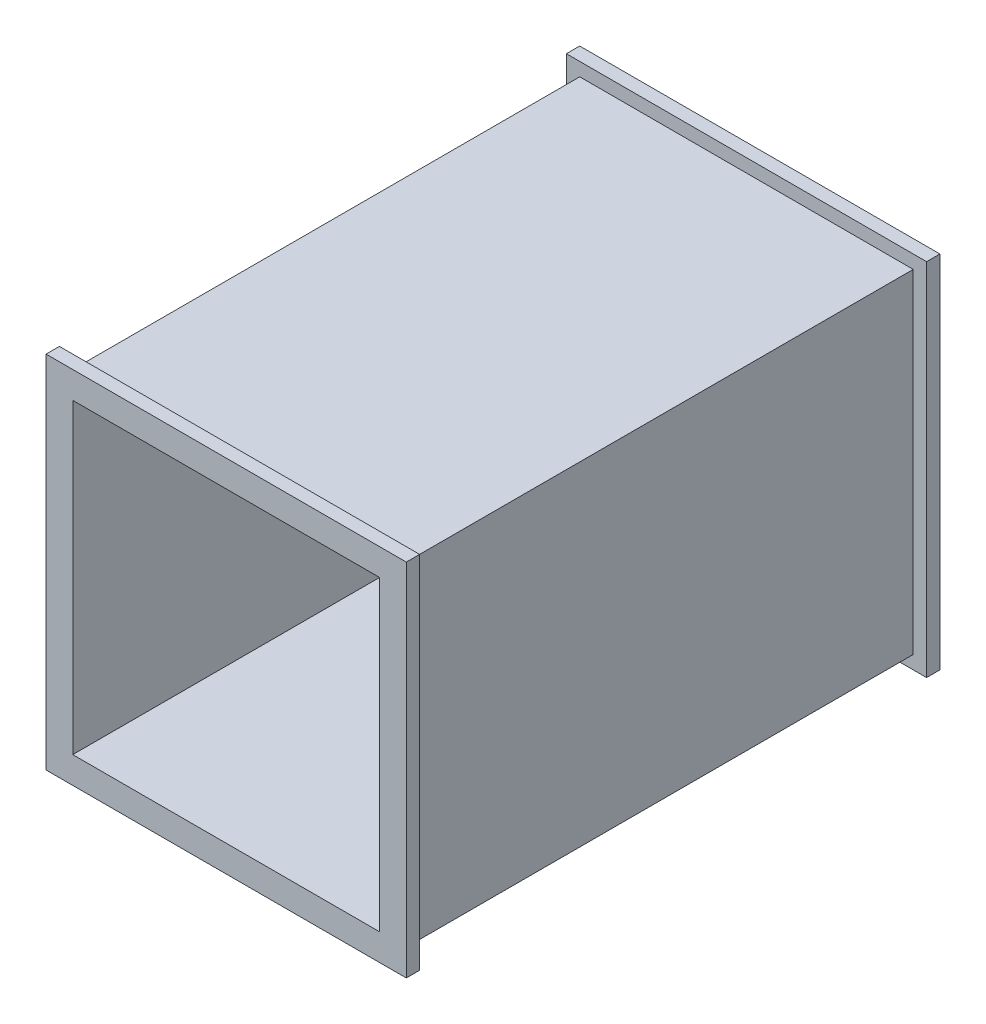
ISO-10303-21;
HEADER;
FILE_DESCRIPTION(('STEP AP214'),'2;1');
FILE_NAME('part.step','',(''),(''),'','','');
FILE_SCHEMA(('AUTOMOTIVE_DESIGN { 1 0 10303 214 1 1 1 1 }'));
ENDSEC;
DATA;
#1=APPLICATION_CONTEXT('core data for automotive mechanical design processes');
#2=APPLICATION_PROTOCOL_DEFINITION('international standard','automotive_design',2000,#1);
#3=PRODUCT_CONTEXT('',#1,'mechanical');
#4=PRODUCT('Part','Part','',(#3));
#5=PRODUCT_RELATED_PRODUCT_CATEGORY('part','',(#4));
#6=PRODUCT_DEFINITION_FORMATION('','',#4);
#7=PRODUCT_DEFINITION_CONTEXT('part definition',#1,'design');
#8=PRODUCT_DEFINITION('design','',#6,#7);
#9=PRODUCT_DEFINITION_SHAPE('','',#8);
#10=(LENGTH_UNIT() NAMED_UNIT(*) SI_UNIT(.MILLI.,.METRE.));
#11=(NAMED_UNIT(*) PLANE_ANGLE_UNIT() SI_UNIT($,.RADIAN.));
#12=(NAMED_UNIT(*) SI_UNIT($,.STERADIAN.) SOLID_ANGLE_UNIT());
#13=UNCERTAINTY_MEASURE_WITH_UNIT(LENGTH_MEASURE(1.E-05),#10,'distance_accuracy_value','');
#14=(GEOMETRIC_REPRESENTATION_CONTEXT(3) GLOBAL_UNCERTAINTY_ASSIGNED_CONTEXT((#13)) GLOBAL_UNIT_ASSIGNED_CONTEXT((#10,
#11,#12)) REPRESENTATION_CONTEXT('',''));
#15=CARTESIAN_POINT('',(0.,0.,0.));
#16=DIRECTION('',(0.,0.,1.));
#17=DIRECTION('',(1.,0.,0.));
#18=AXIS2_PLACEMENT_3D('',#15,#16,#17);
#19=CARTESIAN_POINT('',(-62.5,62.5,200.));
#20=DIRECTION('',(1.,0.,0.));
#21=DIRECTION('',(0.,1.,0.));
#22=AXIS2_PLACEMENT_3D('',#19,#20,#21);
#23=PLANE('',#22);
#24=DIRECTION('',(0.,1.,0.));
#25=VECTOR('',#24,1.);
#26=CARTESIAN_POINT('',(-62.5,-62.5,5.));
#27=LINE('',#26,#25);
#28=CARTESIAN_POINT('',(-62.5,-62.5,5.));
#29=VERTEX_POINT('',#28);
#30=CARTESIAN_POINT('',(-62.5,62.5,5.));
#31=VERTEX_POINT('',#30);
#32=EDGE_CURVE('E54',#29,#31,#27,.T.);
#33=ORIENTED_EDGE('',*,*,#32,.F.);
#34=DIRECTION('',(0.,0.,-1.));
#35=VECTOR('',#34,1.);
#36=CARTESIAN_POINT('',(-62.5,-62.5,200.));
#37=LINE('',#36,#35);
#38=CARTESIAN_POINT('',(-62.5,-62.5,195.));
#39=VERTEX_POINT('',#38);
#40=EDGE_CURVE('E11',#39,#29,#37,.T.);
#41=ORIENTED_EDGE('',*,*,#40,.F.);
#42=DIRECTION('',(0.,-1.,0.));
#43=VECTOR('',#42,1.);
#44=CARTESIAN_POINT('',(-62.5,62.5,195.));
#45=LINE('',#44,#43);
#46=CARTESIAN_POINT('',(-62.5,62.5,195.));
#47=VERTEX_POINT('',#46);
#48=EDGE_CURVE('E173',#47,#39,#45,.T.);
#49=ORIENTED_EDGE('',*,*,#48,.F.);
#50=DIRECTION('',(0.,0.,-1.));
#51=VECTOR('',#50,1.);
#52=CARTESIAN_POINT('',(-62.5,62.5,200.));
#53=LINE('',#52,#51);
#54=EDGE_CURVE('E165',#47,#31,#53,.T.);
#55=ORIENTED_EDGE('',*,*,#54,.T.);
#56=EDGE_LOOP('',(#33,#41,#49,#55));
#57=FACE_BOUND('',#56,.T.);
#58=ADVANCED_FACE('F39',(#57),#23,.F.);
#59=CARTESIAN_POINT('',(-62.5,-62.5,200.));
#60=DIRECTION('',(0.,1.,0.));
#61=DIRECTION('',(0.,0.,1.));
#62=AXIS2_PLACEMENT_3D('',#59,#60,#61);
#63=PLANE('',#62);
#64=DIRECTION('',(-1.,0.,0.));
#65=VECTOR('',#64,1.);
#66=CARTESIAN_POINT('',(62.5,-62.5,5.));
#67=LINE('',#66,#65);
#68=CARTESIAN_POINT('',(62.5,-62.5,5.));
#69=VERTEX_POINT('',#68);
#70=EDGE_CURVE('E150',#69,#29,#67,.T.);
#71=ORIENTED_EDGE('',*,*,#70,.F.);
#72=DIRECTION('',(0.,0.,-1.));
#73=VECTOR('',#72,1.);
#74=CARTESIAN_POINT('',(62.5,-62.5,200.));
#75=LINE('',#74,#73);
#76=CARTESIAN_POINT('',(62.5,-62.5,195.));
#77=VERTEX_POINT('',#76);
#78=EDGE_CURVE('E47',#77,#69,#75,.T.);
#79=ORIENTED_EDGE('',*,*,#78,.F.);
#80=DIRECTION('',(1.,0.,0.));
#81=VECTOR('',#80,1.);
#82=CARTESIAN_POINT('',(-62.5,-62.5,195.));
#83=LINE('',#82,#81);
#84=EDGE_CURVE('E171',#39,#77,#83,.T.);
#85=ORIENTED_EDGE('',*,*,#84,.F.);
#86=ORIENTED_EDGE('',*,*,#40,.T.);
#87=EDGE_LOOP('',(#71,#79,#85,#86));
#88=FACE_BOUND('',#87,.T.);
#89=ADVANCED_FACE('F170',(#88),#63,.F.);
#90=CARTESIAN_POINT('',(62.5,62.5,200.));
#91=DIRECTION('',(1.,0.,0.));
#92=DIRECTION('',(0.,1.,0.));
#93=AXIS2_PLACEMENT_3D('',#90,#91,#92);
#94=PLANE('',#93);
#95=ORIENTED_EDGE('',*,*,#78,.T.);
#96=DIRECTION('',(0.,-1.,0.));
#97=VECTOR('',#96,1.);
#98=CARTESIAN_POINT('',(62.5,62.5,5.));
#99=LINE('',#98,#97);
#100=CARTESIAN_POINT('',(62.5,62.5,5.));
#101=VERTEX_POINT('',#100);
#102=EDGE_CURVE('E154',#101,#69,#99,.T.);
#103=ORIENTED_EDGE('',*,*,#102,.F.);
#104=DIRECTION('',(0.,0.,-1.));
#105=VECTOR('',#104,1.);
#106=CARTESIAN_POINT('',(62.5,62.5,200.));
#107=LINE('',#106,#105);
#108=CARTESIAN_POINT('',(62.5,62.5,195.));
#109=VERTEX_POINT('',#108);
#110=EDGE_CURVE('E271',#109,#101,#107,.T.);
#111=ORIENTED_EDGE('',*,*,#110,.F.);
#112=DIRECTION('',(0.,1.,0.));
#113=VECTOR('',#112,1.);
#114=CARTESIAN_POINT('',(62.5,-62.5,195.));
#115=LINE('',#114,#113);
#116=EDGE_CURVE('E62',#77,#109,#115,.T.);
#117=ORIENTED_EDGE('',*,*,#116,.F.);
#118=EDGE_LOOP('',(#95,#103,#111,#117));
#119=FACE_BOUND('',#118,.T.);
#120=ADVANCED_FACE('F276',(#119),#94,.T.);
#121=CARTESIAN_POINT('',(-62.5,62.5,200.));
#122=DIRECTION('',(0.,1.,0.));
#123=DIRECTION('',(0.,0.,1.));
#124=AXIS2_PLACEMENT_3D('',#121,#122,#123);
#125=PLANE('',#124);
#126=ORIENTED_EDGE('',*,*,#110,.T.);
#127=DIRECTION('',(1.,0.,0.));
#128=VECTOR('',#127,1.);
#129=CARTESIAN_POINT('',(-62.5,62.5,5.));
#130=LINE('',#129,#128);
#131=EDGE_CURVE('E167',#31,#101,#130,.T.);
#132=ORIENTED_EDGE('',*,*,#131,.F.);
#133=ORIENTED_EDGE('',*,*,#54,.F.);
#134=DIRECTION('',(-1.,0.,0.));
#135=VECTOR('',#134,1.);
#136=CARTESIAN_POINT('',(62.5,62.5,195.));
#137=LINE('',#136,#135);
#138=EDGE_CURVE('E179',#109,#47,#137,.T.);
#139=ORIENTED_EDGE('',*,*,#138,.F.);
#140=EDGE_LOOP('',(#126,#132,#133,#139));
#141=FACE_BOUND('',#140,.T.);
#142=ADVANCED_FACE('F279',(#141),#125,.T.);
#143=CARTESIAN_POINT('',(0.,0.,200.));
#144=DIRECTION('',(0.,0.,1.));
#145=DIRECTION('',(1.,0.,0.));
#146=AXIS2_PLACEMENT_3D('',#143,#144,#145);
#147=PLANE('',#146);
#148=DIRECTION('',(0.,-1.,0.));
#149=VECTOR('',#148,1.);
#150=CARTESIAN_POINT('',(-57.5,62.5,200.));
#151=LINE('',#150,#149);
#152=CARTESIAN_POINT('',(-57.5,57.5,200.));
#153=VERTEX_POINT('',#152);
#154=CARTESIAN_POINT('',(-57.5,-57.5,200.));
#155=VERTEX_POINT('',#154);
#156=EDGE_CURVE('E250',#153,#155,#151,.T.);
#157=ORIENTED_EDGE('',*,*,#156,.F.);
#158=DIRECTION('',(1.,0.,0.));
#159=VECTOR('',#158,1.);
#160=CARTESIAN_POINT('',(-62.5,57.5,200.));
#161=LINE('',#160,#159);
#162=CARTESIAN_POINT('',(57.5,57.5,200.));
#163=VERTEX_POINT('',#162);
#164=EDGE_CURVE('E236',#153,#163,#161,.T.);
#165=ORIENTED_EDGE('',*,*,#164,.T.);
#166=DIRECTION('',(0.,-1.,0.));
#167=VECTOR('',#166,1.);
#168=CARTESIAN_POINT('',(57.5,62.5,200.));
#169=LINE('',#168,#167);
#170=CARTESIAN_POINT('',(57.5,-57.5,200.));
#171=VERTEX_POINT('',#170);
#172=EDGE_CURVE('E262',#163,#171,#169,.T.);
#173=ORIENTED_EDGE('',*,*,#172,.T.);
#174=DIRECTION('',(1.,0.,0.));
#175=VECTOR('',#174,1.);
#176=CARTESIAN_POINT('',(-62.5,-57.5,200.));
#177=LINE('',#176,#175);
#178=EDGE_CURVE('E259',#155,#171,#177,.T.);
#179=ORIENTED_EDGE('',*,*,#178,.F.);
#180=EDGE_LOOP('',(#157,#165,#173,#179));
#181=FACE_BOUND('',#180,.T.);
#182=DIRECTION('',(0.,1.,0.));
#183=VECTOR('',#182,1.);
#184=CARTESIAN_POINT('',(67.5,-67.5,200.));
#185=LINE('',#184,#183);
#186=CARTESIAN_POINT('',(67.5,-67.5,200.));
#187=VERTEX_POINT('',#186);
#188=CARTESIAN_POINT('',(67.5,67.5,200.));
#189=VERTEX_POINT('',#188);
#190=EDGE_CURVE('E177',#187,#189,#185,.T.);
#191=ORIENTED_EDGE('',*,*,#190,.T.);
#192=DIRECTION('',(-1.,0.,0.));
#193=VECTOR('',#192,1.);
#194=CARTESIAN_POINT('',(67.5,67.5,200.));
#195=LINE('',#194,#193);
#196=CARTESIAN_POINT('',(-67.5,67.5,200.));
#197=VERTEX_POINT('',#196);
#198=EDGE_CURVE('E204',#189,#197,#195,.T.);
#199=ORIENTED_EDGE('',*,*,#198,.T.);
#200=DIRECTION('',(0.,-1.,0.));
#201=VECTOR('',#200,1.);
#202=CARTESIAN_POINT('',(-67.5,67.5,200.));
#203=LINE('',#202,#201);
#204=CARTESIAN_POINT('',(-67.5,-67.5,200.));
#205=VERTEX_POINT('',#204);
#206=EDGE_CURVE('E208',#197,#205,#203,.T.);
#207=ORIENTED_EDGE('',*,*,#206,.T.);
#208=DIRECTION('',(1.,0.,0.));
#209=VECTOR('',#208,1.);
#210=CARTESIAN_POINT('',(-67.5,-67.5,200.));
#211=LINE('',#210,#209);
#212=EDGE_CURVE('E188',#205,#187,#211,.T.);
#213=ORIENTED_EDGE('',*,*,#212,.T.);
#214=EDGE_LOOP('',(#191,#199,#207,#213));
#215=FACE_BOUND('',#214,.T.);
#216=ADVANCED_FACE('F349',(#181,#215),#147,.T.);
#217=CARTESIAN_POINT('',(0.,0.,0.));
#218=DIRECTION('',(0.,0.,1.));
#219=DIRECTION('',(1.,0.,0.));
#220=AXIS2_PLACEMENT_3D('',#217,#218,#219);
#221=PLANE('',#220);
#222=DIRECTION('',(1.,0.,0.));
#223=VECTOR('',#222,1.);
#224=CARTESIAN_POINT('',(-62.5,57.5,0.));
#225=LINE('',#224,#223);
#226=CARTESIAN_POINT('',(-57.5,57.5,0.));
#227=VERTEX_POINT('',#226);
#228=CARTESIAN_POINT('',(57.5,57.5,0.));
#229=VERTEX_POINT('',#228);
#230=EDGE_CURVE('E246',#227,#229,#225,.T.);
#231=ORIENTED_EDGE('',*,*,#230,.F.);
#232=DIRECTION('',(0.,-1.,0.));
#233=VECTOR('',#232,1.);
#234=CARTESIAN_POINT('',(-57.5,62.5,0.));
#235=LINE('',#234,#233);
#236=CARTESIAN_POINT('',(-57.5,-57.5,0.));
#237=VERTEX_POINT('',#236);
#238=EDGE_CURVE('E218',#227,#237,#235,.T.);
#239=ORIENTED_EDGE('',*,*,#238,.T.);
#240=DIRECTION('',(1.,0.,0.));
#241=VECTOR('',#240,1.);
#242=CARTESIAN_POINT('',(-62.5,-57.5,0.));
#243=LINE('',#242,#241);
#244=CARTESIAN_POINT('',(57.5,-57.5,0.));
#245=VERTEX_POINT('',#244);
#246=EDGE_CURVE('E245',#237,#245,#243,.T.);
#247=ORIENTED_EDGE('',*,*,#246,.T.);
#248=DIRECTION('',(0.,-1.,0.));
#249=VECTOR('',#248,1.);
#250=CARTESIAN_POINT('',(57.5,62.5,0.));
#251=LINE('',#250,#249);
#252=EDGE_CURVE('E251',#229,#245,#251,.T.);
#253=ORIENTED_EDGE('',*,*,#252,.F.);
#254=EDGE_LOOP('',(#231,#239,#247,#253));
#255=FACE_BOUND('',#254,.T.);
#256=DIRECTION('',(0.,1.,0.));
#257=VECTOR('',#256,1.);
#258=CARTESIAN_POINT('',(-67.5,-67.5,0.));
#259=LINE('',#258,#257);
#260=CARTESIAN_POINT('',(-67.5,-67.5,0.));
#261=VERTEX_POINT('',#260);
#262=CARTESIAN_POINT('',(-67.5,67.5,0.));
#263=VERTEX_POINT('',#262);
#264=EDGE_CURVE('E308',#261,#263,#259,.T.);
#265=ORIENTED_EDGE('',*,*,#264,.T.);
#266=DIRECTION('',(1.,0.,0.));
#267=VECTOR('',#266,1.);
#268=CARTESIAN_POINT('',(-67.5,67.5,0.));
#269=LINE('',#268,#267);
#270=CARTESIAN_POINT('',(67.5,67.5,0.));
#271=VERTEX_POINT('',#270);
#272=EDGE_CURVE('E304',#263,#271,#269,.T.);
#273=ORIENTED_EDGE('',*,*,#272,.T.);
#274=DIRECTION('',(0.,-1.,0.));
#275=VECTOR('',#274,1.);
#276=CARTESIAN_POINT('',(67.5,67.5,0.));
#277=LINE('',#276,#275);
#278=CARTESIAN_POINT('',(67.5,-67.5,0.));
#279=VERTEX_POINT('',#278);
#280=EDGE_CURVE('E300',#271,#279,#277,.T.);
#281=ORIENTED_EDGE('',*,*,#280,.T.);
#282=DIRECTION('',(-1.,0.,0.));
#283=VECTOR('',#282,1.);
#284=CARTESIAN_POINT('',(67.5,-67.5,0.));
#285=LINE('',#284,#283);
#286=EDGE_CURVE('E295',#279,#261,#285,.T.);
#287=ORIENTED_EDGE('',*,*,#286,.T.);
#288=EDGE_LOOP('',(#265,#273,#281,#287));
#289=FACE_BOUND('',#288,.T.);
#290=ADVANCED_FACE('F346',(#255,#289),#221,.F.);
#291=CARTESIAN_POINT('',(-57.5,62.5,200.));
#292=DIRECTION('',(1.,0.,0.));
#293=DIRECTION('',(0.,1.,0.));
#294=AXIS2_PLACEMENT_3D('',#291,#292,#293);
#295=PLANE('',#294);
#296=ORIENTED_EDGE('',*,*,#238,.F.);
#297=DIRECTION('',(0.,0.,-1.));
#298=VECTOR('',#297,1.);
#299=CARTESIAN_POINT('',(-57.5,57.5,200.));
#300=LINE('',#299,#298);
#301=EDGE_CURVE('E232',#153,#227,#300,.T.);
#302=ORIENTED_EDGE('',*,*,#301,.F.);
#303=ORIENTED_EDGE('',*,*,#156,.T.);
#304=DIRECTION('',(0.,0.,-1.));
#305=VECTOR('',#304,1.);
#306=CARTESIAN_POINT('',(-57.5,-57.5,200.));
#307=LINE('',#306,#305);
#308=EDGE_CURVE('E227',#155,#237,#307,.T.);
#309=ORIENTED_EDGE('',*,*,#308,.T.);
#310=EDGE_LOOP('',(#296,#302,#303,#309));
#311=FACE_BOUND('',#310,.T.);
#312=ADVANCED_FACE('F348',(#311),#295,.T.);
#313=CARTESIAN_POINT('',(-62.5,-57.5,200.));
#314=DIRECTION('',(0.,1.,0.));
#315=DIRECTION('',(0.,0.,1.));
#316=AXIS2_PLACEMENT_3D('',#313,#314,#315);
#317=PLANE('',#316);
#318=ORIENTED_EDGE('',*,*,#246,.F.);
#319=ORIENTED_EDGE('',*,*,#308,.F.);
#320=ORIENTED_EDGE('',*,*,#178,.T.);
#321=DIRECTION('',(0.,0.,-1.));
#322=VECTOR('',#321,1.);
#323=CARTESIAN_POINT('',(57.5,-57.5,200.));
#324=LINE('',#323,#322);
#325=EDGE_CURVE('E231',#171,#245,#324,.T.);
#326=ORIENTED_EDGE('',*,*,#325,.T.);
#327=EDGE_LOOP('',(#318,#319,#320,#326));
#328=FACE_BOUND('',#327,.T.);
#329=ADVANCED_FACE('F357',(#328),#317,.T.);
#330=CARTESIAN_POINT('',(57.5,62.5,200.));
#331=DIRECTION('',(1.,0.,0.));
#332=DIRECTION('',(0.,1.,0.));
#333=AXIS2_PLACEMENT_3D('',#330,#331,#332);
#334=PLANE('',#333);
#335=ORIENTED_EDGE('',*,*,#252,.T.);
#336=ORIENTED_EDGE('',*,*,#325,.F.);
#337=ORIENTED_EDGE('',*,*,#172,.F.);
#338=DIRECTION('',(0.,0.,-1.));
#339=VECTOR('',#338,1.);
#340=CARTESIAN_POINT('',(57.5,57.5,200.));
#341=LINE('',#340,#339);
#342=EDGE_CURVE('E235',#163,#229,#341,.T.);
#343=ORIENTED_EDGE('',*,*,#342,.T.);
#344=EDGE_LOOP('',(#335,#336,#337,#343));
#345=FACE_BOUND('',#344,.T.);
#346=ADVANCED_FACE('F449',(#345),#334,.F.);
#347=CARTESIAN_POINT('',(-62.5,57.5,200.));
#348=DIRECTION('',(0.,1.,0.));
#349=DIRECTION('',(0.,0.,1.));
#350=AXIS2_PLACEMENT_3D('',#347,#348,#349);
#351=PLANE('',#350);
#352=ORIENTED_EDGE('',*,*,#230,.T.);
#353=ORIENTED_EDGE('',*,*,#342,.F.);
#354=ORIENTED_EDGE('',*,*,#164,.F.);
#355=ORIENTED_EDGE('',*,*,#301,.T.);
#356=EDGE_LOOP('',(#352,#353,#354,#355));
#357=FACE_BOUND('',#356,.T.);
#358=ADVANCED_FACE('F444',(#357),#351,.F.);
#359=CARTESIAN_POINT('',(67.5,-67.5,195.));
#360=DIRECTION('',(1.,0.,0.));
#361=DIRECTION('',(0.,0.,-1.));
#362=AXIS2_PLACEMENT_3D('',#359,#360,#361);
#363=PLANE('',#362);
#364=ORIENTED_EDGE('',*,*,#190,.F.);
#365=DIRECTION('',(0.,0.,1.));
#366=VECTOR('',#365,1.);
#367=CARTESIAN_POINT('',(67.5,-67.5,195.));
#368=LINE('',#367,#366);
#369=CARTESIAN_POINT('',(67.5,-67.5,195.));
#370=VERTEX_POINT('',#369);
#371=EDGE_CURVE('E215',#370,#187,#368,.T.);
#372=ORIENTED_EDGE('',*,*,#371,.F.);
#373=DIRECTION('',(0.,1.,0.));
#374=VECTOR('',#373,1.);
#375=CARTESIAN_POINT('',(67.5,-67.5,195.));
#376=LINE('',#375,#374);
#377=CARTESIAN_POINT('',(67.5,67.5,195.));
#378=VERTEX_POINT('',#377);
#379=EDGE_CURVE('E183',#370,#378,#376,.T.);
#380=ORIENTED_EDGE('',*,*,#379,.T.);
#381=DIRECTION('',(0.,0.,1.));
#382=VECTOR('',#381,1.);
#383=CARTESIAN_POINT('',(67.5,67.5,195.));
#384=LINE('',#383,#382);
#385=EDGE_CURVE('E200',#378,#189,#384,.T.);
#386=ORIENTED_EDGE('',*,*,#385,.T.);
#387=EDGE_LOOP('',(#364,#372,#380,#386));
#388=FACE_BOUND('',#387,.T.);
#389=ADVANCED_FACE('F436',(#388),#363,.T.);
#390=CARTESIAN_POINT('',(-67.5,-67.5,195.));
#391=DIRECTION('',(0.,-1.,0.));
#392=DIRECTION('',(0.,0.,-1.));
#393=AXIS2_PLACEMENT_3D('',#390,#391,#392);
#394=PLANE('',#393);
#395=ORIENTED_EDGE('',*,*,#212,.F.);
#396=DIRECTION('',(0.,0.,1.));
#397=VECTOR('',#396,1.);
#398=CARTESIAN_POINT('',(-67.5,-67.5,195.));
#399=LINE('',#398,#397);
#400=CARTESIAN_POINT('',(-67.5,-67.5,195.));
#401=VERTEX_POINT('',#400);
#402=EDGE_CURVE('E219',#401,#205,#399,.T.);
#403=ORIENTED_EDGE('',*,*,#402,.F.);
#404=DIRECTION('',(1.,0.,0.));
#405=VECTOR('',#404,1.);
#406=CARTESIAN_POINT('',(-67.5,-67.5,195.));
#407=LINE('',#406,#405);
#408=EDGE_CURVE('E196',#401,#370,#407,.T.);
#409=ORIENTED_EDGE('',*,*,#408,.T.);
#410=ORIENTED_EDGE('',*,*,#371,.T.);
#411=EDGE_LOOP('',(#395,#403,#409,#410));
#412=FACE_BOUND('',#411,.T.);
#413=ADVANCED_FACE('F432',(#412),#394,.T.);
#414=CARTESIAN_POINT('',(-67.5,67.5,195.));
#415=DIRECTION('',(-1.,0.,0.));
#416=DIRECTION('',(0.,0.,1.));
#417=AXIS2_PLACEMENT_3D('',#414,#415,#416);
#418=PLANE('',#417);
#419=ORIENTED_EDGE('',*,*,#206,.F.);
#420=DIRECTION('',(0.,0.,1.));
#421=VECTOR('',#420,1.);
#422=CARTESIAN_POINT('',(-67.5,67.5,195.));
#423=LINE('',#422,#421);
#424=CARTESIAN_POINT('',(-67.5,67.5,195.));
#425=VERTEX_POINT('',#424);
#426=EDGE_CURVE('E222',#425,#197,#423,.T.);
#427=ORIENTED_EDGE('',*,*,#426,.F.);
#428=DIRECTION('',(0.,-1.,0.));
#429=VECTOR('',#428,1.);
#430=CARTESIAN_POINT('',(-67.5,67.5,195.));
#431=LINE('',#430,#429);
#432=EDGE_CURVE('E192',#425,#401,#431,.T.);
#433=ORIENTED_EDGE('',*,*,#432,.T.);
#434=ORIENTED_EDGE('',*,*,#402,.T.);
#435=EDGE_LOOP('',(#419,#427,#433,#434));
#436=FACE_BOUND('',#435,.T.);
#437=ADVANCED_FACE('F435',(#436),#418,.T.);
#438=CARTESIAN_POINT('',(67.5,67.5,195.));
#439=DIRECTION('',(0.,1.,0.));
#440=DIRECTION('',(0.,0.,1.));
#441=AXIS2_PLACEMENT_3D('',#438,#439,#440);
#442=PLANE('',#441);
#443=ORIENTED_EDGE('',*,*,#198,.F.);
#444=ORIENTED_EDGE('',*,*,#385,.F.);
#445=DIRECTION('',(-1.,0.,0.));
#446=VECTOR('',#445,1.);
#447=CARTESIAN_POINT('',(67.5,67.5,195.));
#448=LINE('',#447,#446);
#449=EDGE_CURVE('E187',#378,#425,#448,.T.);
#450=ORIENTED_EDGE('',*,*,#449,.T.);
#451=ORIENTED_EDGE('',*,*,#426,.T.);
#452=EDGE_LOOP('',(#443,#444,#450,#451));
#453=FACE_BOUND('',#452,.T.);
#454=ADVANCED_FACE('F431',(#453),#442,.T.);
#455=CARTESIAN_POINT('',(0.,0.,195.));
#456=DIRECTION('',(0.,0.,1.));
#457=DIRECTION('',(1.,0.,0.));
#458=AXIS2_PLACEMENT_3D('',#455,#456,#457);
#459=PLANE('',#458);
#460=ORIENTED_EDGE('',*,*,#116,.T.);
#461=ORIENTED_EDGE('',*,*,#138,.T.);
#462=ORIENTED_EDGE('',*,*,#48,.T.);
#463=ORIENTED_EDGE('',*,*,#84,.T.);
#464=EDGE_LOOP('',(#460,#461,#462,#463));
#465=FACE_BOUND('',#464,.T.);
#466=ORIENTED_EDGE('',*,*,#379,.F.);
#467=ORIENTED_EDGE('',*,*,#408,.F.);
#468=ORIENTED_EDGE('',*,*,#432,.F.);
#469=ORIENTED_EDGE('',*,*,#449,.F.);
#470=EDGE_LOOP('',(#466,#467,#468,#469));
#471=FACE_BOUND('',#470,.T.);
#472=ADVANCED_FACE('F392',(#465,#471),#459,.F.);
#473=CARTESIAN_POINT('',(-67.5,-67.5,5.));
#474=DIRECTION('',(-1.,0.,0.));
#475=DIRECTION('',(0.,0.,1.));
#476=AXIS2_PLACEMENT_3D('',#473,#474,#475);
#477=PLANE('',#476);
#478=ORIENTED_EDGE('',*,*,#264,.F.);
#479=DIRECTION('',(0.,0.,-1.));
#480=VECTOR('',#479,1.);
#481=CARTESIAN_POINT('',(-67.5,-67.5,5.));
#482=LINE('',#481,#480);
#483=CARTESIAN_POINT('',(-67.5,-67.5,5.));
#484=VERTEX_POINT('',#483);
#485=EDGE_CURVE('E281',#484,#261,#482,.T.);
#486=ORIENTED_EDGE('',*,*,#485,.F.);
#487=DIRECTION('',(0.,1.,0.));
#488=VECTOR('',#487,1.);
#489=CARTESIAN_POINT('',(-67.5,-67.5,5.));
#490=LINE('',#489,#488);
#491=CARTESIAN_POINT('',(-67.5,67.5,5.));
#492=VERTEX_POINT('',#491);
#493=EDGE_CURVE('E299',#484,#492,#490,.T.);
#494=ORIENTED_EDGE('',*,*,#493,.T.);
#495=DIRECTION('',(0.,0.,-1.));
#496=VECTOR('',#495,1.);
#497=CARTESIAN_POINT('',(-67.5,67.5,5.));
#498=LINE('',#497,#496);
#499=EDGE_CURVE('E286',#492,#263,#498,.T.);
#500=ORIENTED_EDGE('',*,*,#499,.T.);
#501=EDGE_LOOP('',(#478,#486,#494,#500));
#502=FACE_BOUND('',#501,.T.);
#503=ADVANCED_FACE('F332',(#502),#477,.T.);
#504=CARTESIAN_POINT('',(67.5,-67.5,5.));
#505=DIRECTION('',(0.,-1.,0.));
#506=DIRECTION('',(0.,0.,-1.));
#507=AXIS2_PLACEMENT_3D('',#504,#505,#506);
#508=PLANE('',#507);
#509=ORIENTED_EDGE('',*,*,#286,.F.);
#510=DIRECTION('',(0.,0.,-1.));
#511=VECTOR('',#510,1.);
#512=CARTESIAN_POINT('',(67.5,-67.5,5.));
#513=LINE('',#512,#511);
#514=CARTESIAN_POINT('',(67.5,-67.5,5.));
#515=VERTEX_POINT('',#514);
#516=EDGE_CURVE('E283',#515,#279,#513,.T.);
#517=ORIENTED_EDGE('',*,*,#516,.F.);
#518=DIRECTION('',(-1.,0.,0.));
#519=VECTOR('',#518,1.);
#520=CARTESIAN_POINT('',(67.5,-67.5,5.));
#521=LINE('',#520,#519);
#522=EDGE_CURVE('E290',#515,#484,#521,.T.);
#523=ORIENTED_EDGE('',*,*,#522,.T.);
#524=ORIENTED_EDGE('',*,*,#485,.T.);
#525=EDGE_LOOP('',(#509,#517,#523,#524));
#526=FACE_BOUND('',#525,.T.);
#527=ADVANCED_FACE('F339',(#526),#508,.T.);
#528=CARTESIAN_POINT('',(67.5,67.5,5.));
#529=DIRECTION('',(1.,0.,0.));
#530=DIRECTION('',(0.,0.,-1.));
#531=AXIS2_PLACEMENT_3D('',#528,#529,#530);
#532=PLANE('',#531);
#533=ORIENTED_EDGE('',*,*,#280,.F.);
#534=DIRECTION('',(0.,0.,-1.));
#535=VECTOR('',#534,1.);
#536=CARTESIAN_POINT('',(67.5,67.5,5.));
#537=LINE('',#536,#535);
#538=CARTESIAN_POINT('',(67.5,67.5,5.));
#539=VERTEX_POINT('',#538);
#540=EDGE_CURVE('E289',#539,#271,#537,.T.);
#541=ORIENTED_EDGE('',*,*,#540,.F.);
#542=DIRECTION('',(0.,-1.,0.));
#543=VECTOR('',#542,1.);
#544=CARTESIAN_POINT('',(67.5,67.5,5.));
#545=LINE('',#544,#543);
#546=EDGE_CURVE('E315',#539,#515,#545,.T.);
#547=ORIENTED_EDGE('',*,*,#546,.T.);
#548=ORIENTED_EDGE('',*,*,#516,.T.);
#549=EDGE_LOOP('',(#533,#541,#547,#548));
#550=FACE_BOUND('',#549,.T.);
#551=ADVANCED_FACE('F342',(#550),#532,.T.);
#552=CARTESIAN_POINT('',(-67.5,67.5,5.));
#553=DIRECTION('',(0.,1.,0.));
#554=DIRECTION('',(0.,0.,1.));
#555=AXIS2_PLACEMENT_3D('',#552,#553,#554);
#556=PLANE('',#555);
#557=ORIENTED_EDGE('',*,*,#272,.F.);
#558=ORIENTED_EDGE('',*,*,#499,.F.);
#559=DIRECTION('',(1.,0.,0.));
#560=VECTOR('',#559,1.);
#561=CARTESIAN_POINT('',(-67.5,67.5,5.));
#562=LINE('',#561,#560);
#563=EDGE_CURVE('E319',#492,#539,#562,.T.);
#564=ORIENTED_EDGE('',*,*,#563,.T.);
#565=ORIENTED_EDGE('',*,*,#540,.T.);
#566=EDGE_LOOP('',(#557,#558,#564,#565));
#567=FACE_BOUND('',#566,.T.);
#568=ADVANCED_FACE('F344',(#567),#556,.T.);
#569=CARTESIAN_POINT('',(0.,0.,5.));
#570=DIRECTION('',(0.,0.,-1.));
#571=DIRECTION('',(-1.,0.,0.));
#572=AXIS2_PLACEMENT_3D('',#569,#570,#571);
#573=PLANE('',#572);
#574=ORIENTED_EDGE('',*,*,#102,.T.);
#575=ORIENTED_EDGE('',*,*,#70,.T.);
#576=ORIENTED_EDGE('',*,*,#32,.T.);
#577=ORIENTED_EDGE('',*,*,#131,.T.);
#578=EDGE_LOOP('',(#574,#575,#576,#577));
#579=FACE_BOUND('',#578,.T.);
#580=ORIENTED_EDGE('',*,*,#493,.F.);
#581=ORIENTED_EDGE('',*,*,#522,.F.);
#582=ORIENTED_EDGE('',*,*,#546,.F.);
#583=ORIENTED_EDGE('',*,*,#563,.F.);
#584=EDGE_LOOP('',(#580,#581,#582,#583));
#585=FACE_BOUND('',#584,.T.);
#586=ADVANCED_FACE('F151',(#579,#585),#573,.F.);
#587=CLOSED_SHELL('',(#58,#89,#120,#142,#216,#290,#312,#329,#346,#358,#389,#413,#437,#454,#472,
#503,#527,#551,#568,#586));
#588=MANIFOLD_SOLID_BREP('B2',#587);
#589=ADVANCED_BREP_SHAPE_REPRESENTATION('',(#18,#588),#14);
#590=SHAPE_DEFINITION_REPRESENTATION(#9,#589);
ENDSEC;
END-ISO-10303-21;
